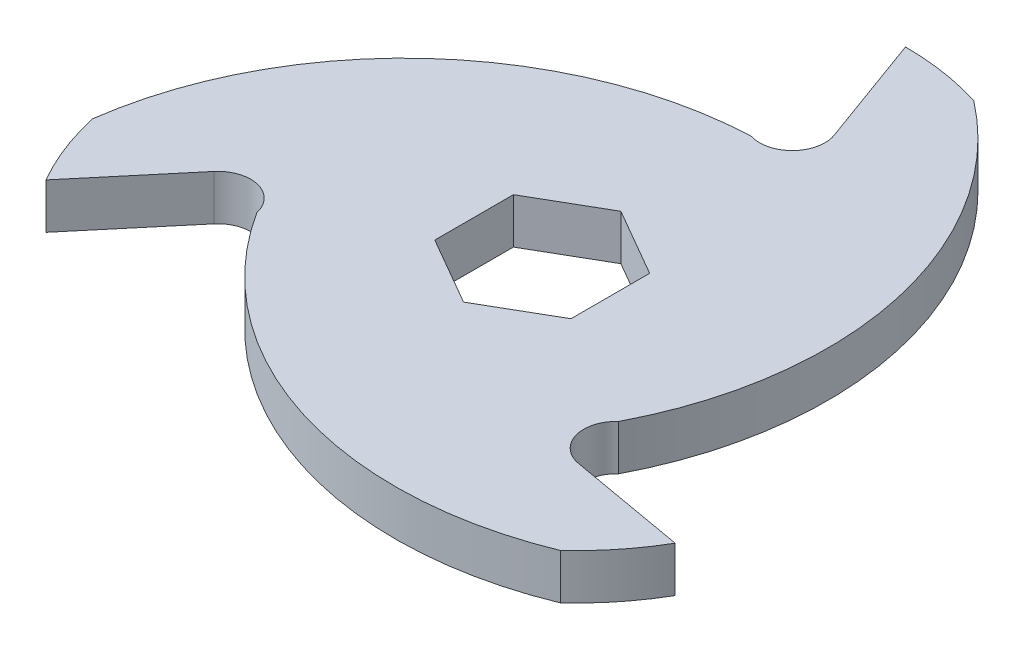
ISO-10303-21;
HEADER;
FILE_DESCRIPTION(('STEP AP214'),'2;1');
FILE_NAME('part.step','',(''),(''),'','','');
FILE_SCHEMA(('AUTOMOTIVE_DESIGN { 1 0 10303 214 1 1 1 1 }'));
ENDSEC;
DATA;
#1=APPLICATION_CONTEXT('core data for automotive mechanical design processes');
#2=APPLICATION_PROTOCOL_DEFINITION('international standard','automotive_design',2000,#1);
#3=PRODUCT_CONTEXT('',#1,'mechanical');
#4=PRODUCT('Part','Part','',(#3));
#5=PRODUCT_RELATED_PRODUCT_CATEGORY('part','',(#4));
#6=PRODUCT_DEFINITION_FORMATION('','',#4);
#7=PRODUCT_DEFINITION_CONTEXT('part definition',#1,'design');
#8=PRODUCT_DEFINITION('design','',#6,#7);
#9=PRODUCT_DEFINITION_SHAPE('','',#8);
#10=(LENGTH_UNIT() NAMED_UNIT(*) SI_UNIT(.MILLI.,.METRE.));
#11=(NAMED_UNIT(*) PLANE_ANGLE_UNIT() SI_UNIT($,.RADIAN.));
#12=(NAMED_UNIT(*) SI_UNIT($,.STERADIAN.) SOLID_ANGLE_UNIT());
#13=UNCERTAINTY_MEASURE_WITH_UNIT(LENGTH_MEASURE(1.E-05),#10,'distance_accuracy_value','');
#14=(GEOMETRIC_REPRESENTATION_CONTEXT(3) GLOBAL_UNCERTAINTY_ASSIGNED_CONTEXT((#13)) GLOBAL_UNIT_ASSIGNED_CONTEXT((#10,
#11,#12)) REPRESENTATION_CONTEXT('',''));
#15=CARTESIAN_POINT('',(0.,0.,0.));
#16=DIRECTION('',(0.,0.,1.));
#17=DIRECTION('',(1.,0.,0.));
#18=AXIS2_PLACEMENT_3D('',#15,#16,#17);
#19=CARTESIAN_POINT('',(0.,3.175,0.));
#20=DIRECTION('',(0.,1.,0.));
#21=DIRECTION('',(0.,0.,1.));
#22=AXIS2_PLACEMENT_3D('',#19,#20,#21);
#23=PLANE('',#22);
#24=DIRECTION('',(-0.866025403784439,0.,-0.5));
#25=VECTOR('',#24,1.);
#26=CARTESIAN_POINT('',(4.7625,3.175,-8.24889197104678));
#27=LINE('',#26,#25);
#28=CARTESIAN_POINT('',(9.52499999999999,3.175,-5.49926131403119));
#29=VERTEX_POINT('',#28);
#30=CARTESIAN_POINT('',(0.,3.175,-10.9985226280624));
#31=VERTEX_POINT('',#30);
#32=EDGE_CURVE('E240',#29,#31,#27,.T.);
#33=ORIENTED_EDGE('',*,*,#32,.F.);
#34=DIRECTION('',(0.,0.,-1.));
#35=VECTOR('',#34,1.);
#36=CARTESIAN_POINT('',(9.52499999999999,3.175,0.));
#37=LINE('',#36,#35);
#38=CARTESIAN_POINT('',(9.525,3.175,5.4992613140312));
#39=VERTEX_POINT('',#38);
#40=EDGE_CURVE('E269',#39,#29,#37,.T.);
#41=ORIENTED_EDGE('',*,*,#40,.F.);
#42=DIRECTION('',(0.866025403784439,0.,-0.5));
#43=VECTOR('',#42,1.);
#44=CARTESIAN_POINT('',(4.7625,3.175,8.24889197104679));
#45=LINE('',#44,#43);
#46=CARTESIAN_POINT('',(0.,3.175,10.9985226280624));
#47=VERTEX_POINT('',#46);
#48=EDGE_CURVE('E277',#47,#39,#45,.T.);
#49=ORIENTED_EDGE('',*,*,#48,.F.);
#50=DIRECTION('',(0.866025403784439,0.,0.5));
#51=VECTOR('',#50,1.);
#52=CARTESIAN_POINT('',(-4.76250000000001,3.175,8.24889197104678));
#53=LINE('',#52,#51);
#54=CARTESIAN_POINT('',(-9.52500000000001,3.175,5.49926131403119));
#55=VERTEX_POINT('',#54);
#56=EDGE_CURVE('E283',#55,#47,#53,.T.);
#57=ORIENTED_EDGE('',*,*,#56,.F.);
#58=DIRECTION('',(0.,0.,1.));
#59=VECTOR('',#58,1.);
#60=CARTESIAN_POINT('',(-9.52500000000001,3.175,0.));
#61=LINE('',#60,#59);
#62=CARTESIAN_POINT('',(-9.52500000000001,3.175,-5.49926131403119));
#63=VERTEX_POINT('',#62);
#64=EDGE_CURVE('E287',#63,#55,#61,.T.);
#65=ORIENTED_EDGE('',*,*,#64,.F.);
#66=DIRECTION('',(-0.866025403784439,0.,0.5));
#67=VECTOR('',#66,1.);
#68=CARTESIAN_POINT('',(-4.7625,3.175,-8.24889197104678));
#69=LINE('',#68,#67);
#70=EDGE_CURVE('E289',#31,#63,#69,.T.);
#71=ORIENTED_EDGE('',*,*,#70,.F.);
#72=EDGE_LOOP('',(#33,#41,#49,#57,#65,#71));
#73=FACE_BOUND('',#72,.T.);
#74=CARTESIAN_POINT('',(-19.758832767773,3.175,-8.86088574661333));
#75=DIRECTION('',(0.,1.,0.));
#76=DIRECTION('',(0.,0.,1.));
#77=AXIS2_PLACEMENT_3D('',#74,#75,#76);
#78=CIRCLE('',#77,50.8);
#79=CARTESIAN_POINT('',(11.2971590607652,3.175,-49.0624450639554));
#80=VERTEX_POINT('',#79);
#81=CARTESIAN_POINT('',(25.2966020445434,3.175,14.605));
#82=VERTEX_POINT('',#81);
#83=EDGE_CURVE('E308',#80,#82,#78,.F.);
#84=ORIENTED_EDGE('',*,*,#83,.F.);
#85=CARTESIAN_POINT('',(0.,3.175,-13.2055339805825));
#86=DIRECTION('',(0.,1.,0.));
#87=DIRECTION('',(0.,0.,1.));
#88=AXIS2_PLACEMENT_3D('',#85,#86,#87);
#89=CIRCLE('',#88,37.5944660194175);
#90=CARTESIAN_POINT('',(0.,3.175,-50.8));
#91=VERTEX_POINT('',#90);
#92=EDGE_CURVE('E180',#80,#91,#89,.T.);
#93=ORIENTED_EDGE('',*,*,#92,.T.);
#94=DIRECTION('',(0.342020143325669,0.,0.939692620785908));
#95=VECTOR('',#94,1.);
#96=CARTESIAN_POINT('',(16.3268052860381,3.175,-5.94247114477798));
#97=LINE('',#96,#95);
#98=CARTESIAN_POINT('',(5.69918249679369,3.175,-35.1416247807083));
#99=VERTEX_POINT('',#98);
#100=EDGE_CURVE('E172',#91,#99,#97,.T.);
#101=ORIENTED_EDGE('',*,*,#100,.T.);
#102=CARTESIAN_POINT('',(1.39377125197146,3.175,-33.574583241318));
#103=DIRECTION('',(0.,1.,0.));
#104=DIRECTION('',(0.,0.,1.));
#105=AXIS2_PLACEMENT_3D('',#102,#103,#104);
#106=CIRCLE('',#105,4.58172294810767);
#107=CARTESIAN_POINT('',(0.,3.175,-29.21));
#108=VERTEX_POINT('',#107);
#109=EDGE_CURVE('E177',#99,#108,#106,.F.);
#110=ORIENTED_EDGE('',*,*,#109,.T.);
#111=CARTESIAN_POINT('',(2.20566422728801,3.175,21.5420939993265));
#112=DIRECTION('',(0.,1.,0.));
#113=DIRECTION('',(0.,0.,1.));
#114=AXIS2_PLACEMENT_3D('',#111,#112,#113);
#115=CIRCLE('',#114,50.8);
#116=CARTESIAN_POINT('',(-48.1379033275463,3.175,14.7475957947618));
#117=VERTEX_POINT('',#116);
#118=EDGE_CURVE('E327',#117,#108,#115,.F.);
#119=ORIENTED_EDGE('',*,*,#118,.F.);
#120=CARTESIAN_POINT('',(-11.4363278977231,3.175,6.60276699029124));
#121=DIRECTION('',(0.,1.,0.));
#122=DIRECTION('',(0.,0.,1.));
#123=AXIS2_PLACEMENT_3D('',#120,#121,#122);
#124=CIRCLE('',#123,37.5944660194175);
#125=CARTESIAN_POINT('',(-43.9940905122493,3.175,25.4));
#126=VERTEX_POINT('',#125);
#127=EDGE_CURVE('E197',#117,#126,#124,.T.);
#128=ORIENTED_EDGE('',*,*,#127,.T.);
#129=DIRECTION('',(0.642787609686538,0.,-0.766044443118979));
#130=VECTOR('',#129,1.);
#131=CARTESIAN_POINT('',(-13.3097336156527,3.175,-11.168192567962));
#132=LINE('',#131,#130);
#133=CARTESIAN_POINT('',(-33.2831310387509,3.175,12.6351755673272));
#134=VERTEX_POINT('',#133);
#135=EDGE_CURVE('E78',#126,#134,#132,.T.);
#136=ORIENTED_EDGE('',*,*,#135,.T.);
#137=CARTESIAN_POINT('',(-29.7733276344423,3.175,15.5802503093873));
#138=DIRECTION('',(0.,1.,0.));
#139=DIRECTION('',(0.,0.,1.));
#140=AXIS2_PLACEMENT_3D('',#137,#138,#139);
#141=CIRCLE('',#140,4.58172294810767);
#142=CARTESIAN_POINT('',(-25.2966020445434,3.175,14.605));
#143=VERTEX_POINT('',#142);
#144=EDGE_CURVE('E295',#134,#143,#141,.F.);
#145=ORIENTED_EDGE('',*,*,#144,.T.);
#146=CARTESIAN_POINT('',(17.5531685404851,3.175,-12.6812082527131));
#147=DIRECTION('',(0.,1.,0.));
#148=DIRECTION('',(0.,0.,1.));
#149=AXIS2_PLACEMENT_3D('',#146,#147,#148);
#150=CIRCLE('',#149,50.8);
#151=CARTESIAN_POINT('',(36.840744266781,3.175,34.3148492691941));
#152=VERTEX_POINT('',#151);
#153=EDGE_CURVE('E406',#152,#143,#150,.F.);
#154=ORIENTED_EDGE('',*,*,#153,.F.);
#155=CARTESIAN_POINT('',(11.4363278977231,3.175,6.60276699029124));
#156=DIRECTION('',(0.,1.,0.));
#157=DIRECTION('',(0.,0.,1.));
#158=AXIS2_PLACEMENT_3D('',#155,#156,#157);
#159=CIRCLE('',#158,37.5944660194175);
#160=CARTESIAN_POINT('',(43.9940905122496,3.175,25.3999999999999));
#161=VERTEX_POINT('',#160);
#162=EDGE_CURVE('E297',#152,#161,#159,.T.);
#163=ORIENTED_EDGE('',*,*,#162,.T.);
#164=DIRECTION('',(-0.984807753012208,0.,-0.173648177666931));
#165=VECTOR('',#164,1.);
#166=CARTESIAN_POINT('',(-3.01707167038532,3.175,17.1106637127399));
#167=LINE('',#166,#165);
#168=CARTESIAN_POINT('',(27.5839485419574,3.175,22.506449213381));
#169=VERTEX_POINT('',#168);
#170=EDGE_CURVE('E299',#161,#169,#167,.T.);
#171=ORIENTED_EDGE('',*,*,#170,.T.);
#172=CARTESIAN_POINT('',(28.379556382471,3.175,17.9943329319306));
#173=DIRECTION('',(0.,1.,0.));
#174=DIRECTION('',(0.,0.,1.));
#175=AXIS2_PLACEMENT_3D('',#172,#173,#174);
#176=CIRCLE('',#175,4.58172294810767);
#177=EDGE_CURVE('E301',#169,#82,#176,.F.);
#178=ORIENTED_EDGE('',*,*,#177,.T.);
#179=EDGE_LOOP('',(#84,#93,#101,#110,#119,#128,#136,#145,#154,#163,#171,#178));
#180=FACE_BOUND('',#179,.T.);
#181=ADVANCED_FACE('F59',(#73,#180),#23,.T.);
#182=CARTESIAN_POINT('',(0.,-3.175,0.));
#183=DIRECTION('',(0.,1.,0.));
#184=DIRECTION('',(0.,0.,1.));
#185=AXIS2_PLACEMENT_3D('',#182,#183,#184);
#186=PLANE('',#185);
#187=DIRECTION('',(-0.866025403784439,0.,-0.5));
#188=VECTOR('',#187,1.);
#189=CARTESIAN_POINT('',(4.7625,-3.175,-8.24889197104678));
#190=LINE('',#189,#188);
#191=CARTESIAN_POINT('',(9.52499999999999,-3.175,-5.49926131403119));
#192=VERTEX_POINT('',#191);
#193=CARTESIAN_POINT('',(0.,-3.175,-10.9985226280624));
#194=VERTEX_POINT('',#193);
#195=EDGE_CURVE('E204',#192,#194,#190,.T.);
#196=ORIENTED_EDGE('',*,*,#195,.T.);
#197=DIRECTION('',(-0.866025403784439,0.,0.5));
#198=VECTOR('',#197,1.);
#199=CARTESIAN_POINT('',(-4.7625,-3.175,-8.24889197104678));
#200=LINE('',#199,#198);
#201=CARTESIAN_POINT('',(-9.52500000000001,-3.175,-5.49926131403119));
#202=VERTEX_POINT('',#201);
#203=EDGE_CURVE('E220',#194,#202,#200,.T.);
#204=ORIENTED_EDGE('',*,*,#203,.T.);
#205=DIRECTION('',(0.,0.,1.));
#206=VECTOR('',#205,1.);
#207=CARTESIAN_POINT('',(-9.52500000000001,-3.175,0.));
#208=LINE('',#207,#206);
#209=CARTESIAN_POINT('',(-9.52500000000001,-3.175,5.49926131403119));
#210=VERTEX_POINT('',#209);
#211=EDGE_CURVE('E217',#202,#210,#208,.T.);
#212=ORIENTED_EDGE('',*,*,#211,.T.);
#213=DIRECTION('',(0.866025403784439,0.,0.5));
#214=VECTOR('',#213,1.);
#215=CARTESIAN_POINT('',(-4.76250000000001,-3.175,8.24889197104678));
#216=LINE('',#215,#214);
#217=CARTESIAN_POINT('',(0.,-3.175,10.9985226280624));
#218=VERTEX_POINT('',#217);
#219=EDGE_CURVE('E214',#210,#218,#216,.T.);
#220=ORIENTED_EDGE('',*,*,#219,.T.);
#221=DIRECTION('',(0.866025403784439,0.,-0.5));
#222=VECTOR('',#221,1.);
#223=CARTESIAN_POINT('',(4.7625,-3.175,8.24889197104679));
#224=LINE('',#223,#222);
#225=CARTESIAN_POINT('',(9.525,-3.175,5.4992613140312));
#226=VERTEX_POINT('',#225);
#227=EDGE_CURVE('E211',#218,#226,#224,.T.);
#228=ORIENTED_EDGE('',*,*,#227,.T.);
#229=DIRECTION('',(0.,0.,-1.));
#230=VECTOR('',#229,1.);
#231=CARTESIAN_POINT('',(9.52499999999999,-3.175,0.));
#232=LINE('',#231,#230);
#233=EDGE_CURVE('E207',#226,#192,#232,.T.);
#234=ORIENTED_EDGE('',*,*,#233,.T.);
#235=EDGE_LOOP('',(#196,#204,#212,#220,#228,#234));
#236=FACE_BOUND('',#235,.T.);
#237=CARTESIAN_POINT('',(0.,-3.175,-13.2055339805825));
#238=DIRECTION('',(0.,1.,0.));
#239=DIRECTION('',(0.,0.,1.));
#240=AXIS2_PLACEMENT_3D('',#237,#238,#239);
#241=CIRCLE('',#240,37.5944660194175);
#242=CARTESIAN_POINT('',(11.2971590607652,-3.175,-49.0624450639554));
#243=VERTEX_POINT('',#242);
#244=CARTESIAN_POINT('',(0.,-3.175,-50.8));
#245=VERTEX_POINT('',#244);
#246=EDGE_CURVE('E233',#243,#245,#241,.T.);
#247=ORIENTED_EDGE('',*,*,#246,.F.);
#248=CARTESIAN_POINT('',(-19.758832767773,-3.175,-8.86088574661333));
#249=DIRECTION('',(0.,1.,0.));
#250=DIRECTION('',(0.,0.,1.));
#251=AXIS2_PLACEMENT_3D('',#248,#249,#250);
#252=CIRCLE('',#251,50.8);
#253=CARTESIAN_POINT('',(25.2966020445434,-3.175,14.605));
#254=VERTEX_POINT('',#253);
#255=EDGE_CURVE('E321',#243,#254,#252,.F.);
#256=ORIENTED_EDGE('',*,*,#255,.T.);
#257=CARTESIAN_POINT('',(28.379556382471,-3.175,17.9943329319306));
#258=DIRECTION('',(0.,1.,0.));
#259=DIRECTION('',(0.,0.,1.));
#260=AXIS2_PLACEMENT_3D('',#257,#258,#259);
#261=CIRCLE('',#260,4.58172294810767);
#262=CARTESIAN_POINT('',(27.5839485419574,-3.175,22.506449213381));
#263=VERTEX_POINT('',#262);
#264=EDGE_CURVE('E230',#263,#254,#261,.F.);
#265=ORIENTED_EDGE('',*,*,#264,.F.);
#266=DIRECTION('',(-0.984807753012208,0.,-0.173648177666931));
#267=VECTOR('',#266,1.);
#268=CARTESIAN_POINT('',(-3.01707167038532,-3.175,17.1106637127399));
#269=LINE('',#268,#267);
#270=CARTESIAN_POINT('',(43.9940905122496,-3.175,25.3999999999999));
#271=VERTEX_POINT('',#270);
#272=EDGE_CURVE('E228',#271,#263,#269,.T.);
#273=ORIENTED_EDGE('',*,*,#272,.F.);
#274=CARTESIAN_POINT('',(11.4363278977231,-3.175,6.60276699029124));
#275=DIRECTION('',(0.,1.,0.));
#276=DIRECTION('',(0.,0.,1.));
#277=AXIS2_PLACEMENT_3D('',#274,#275,#276);
#278=CIRCLE('',#277,37.5944660194175);
#279=CARTESIAN_POINT('',(36.840744266781,-3.175,34.3148492691941));
#280=VERTEX_POINT('',#279);
#281=EDGE_CURVE('E226',#280,#271,#278,.T.);
#282=ORIENTED_EDGE('',*,*,#281,.F.);
#283=CARTESIAN_POINT('',(17.5531685404851,-3.175,-12.6812082527131));
#284=DIRECTION('',(0.,1.,0.));
#285=DIRECTION('',(0.,0.,1.));
#286=AXIS2_PLACEMENT_3D('',#283,#284,#285);
#287=CIRCLE('',#286,50.8);
#288=CARTESIAN_POINT('',(-25.2966020445434,-3.175,14.605));
#289=VERTEX_POINT('',#288);
#290=EDGE_CURVE('E401',#280,#289,#287,.F.);
#291=ORIENTED_EDGE('',*,*,#290,.T.);
#292=CARTESIAN_POINT('',(-29.7733276344423,-3.175,15.5802503093873));
#293=DIRECTION('',(0.,1.,0.));
#294=DIRECTION('',(0.,0.,1.));
#295=AXIS2_PLACEMENT_3D('',#292,#293,#294);
#296=CIRCLE('',#295,4.58172294810767);
#297=CARTESIAN_POINT('',(-33.2831310387509,-3.175,12.6351755673272));
#298=VERTEX_POINT('',#297);
#299=EDGE_CURVE('E223',#298,#289,#296,.F.);
#300=ORIENTED_EDGE('',*,*,#299,.F.);
#301=DIRECTION('',(0.642787609686538,0.,-0.766044443118979));
#302=VECTOR('',#301,1.);
#303=CARTESIAN_POINT('',(-13.3097336156527,-3.175,-11.168192567962));
#304=LINE('',#303,#302);
#305=CARTESIAN_POINT('',(-43.9940905122493,-3.175,25.4));
#306=VERTEX_POINT('',#305);
#307=EDGE_CURVE('E134',#306,#298,#304,.T.);
#308=ORIENTED_EDGE('',*,*,#307,.F.);
#309=CARTESIAN_POINT('',(-11.4363278977231,-3.175,6.60276699029124));
#310=DIRECTION('',(0.,1.,0.));
#311=DIRECTION('',(0.,0.,1.));
#312=AXIS2_PLACEMENT_3D('',#309,#310,#311);
#313=CIRCLE('',#312,37.5944660194175);
#314=CARTESIAN_POINT('',(-48.1379033275463,-3.175,14.7475957947618));
#315=VERTEX_POINT('',#314);
#316=EDGE_CURVE('E128',#315,#306,#313,.T.);
#317=ORIENTED_EDGE('',*,*,#316,.F.);
#318=CARTESIAN_POINT('',(2.20566422728801,-3.175,21.5420939993265));
#319=DIRECTION('',(0.,1.,0.));
#320=DIRECTION('',(0.,0.,1.));
#321=AXIS2_PLACEMENT_3D('',#318,#319,#320);
#322=CIRCLE('',#321,50.8);
#323=CARTESIAN_POINT('',(0.,-3.175,-29.21));
#324=VERTEX_POINT('',#323);
#325=EDGE_CURVE('E334',#315,#324,#322,.F.);
#326=ORIENTED_EDGE('',*,*,#325,.T.);
#327=CARTESIAN_POINT('',(1.39377125197146,-3.175,-33.574583241318));
#328=DIRECTION('',(0.,1.,0.));
#329=DIRECTION('',(0.,0.,1.));
#330=AXIS2_PLACEMENT_3D('',#327,#328,#329);
#331=CIRCLE('',#330,4.58172294810767);
#332=CARTESIAN_POINT('',(5.69918249679369,-3.175,-35.1416247807083));
#333=VERTEX_POINT('',#332);
#334=EDGE_CURVE('E236',#333,#324,#331,.F.);
#335=ORIENTED_EDGE('',*,*,#334,.F.);
#336=DIRECTION('',(0.342020143325669,0.,0.939692620785908));
#337=VECTOR('',#336,1.);
#338=CARTESIAN_POINT('',(16.3268052860381,-3.175,-5.94247114477798));
#339=LINE('',#338,#337);
#340=EDGE_CURVE('E189',#245,#333,#339,.T.);
#341=ORIENTED_EDGE('',*,*,#340,.F.);
#342=EDGE_LOOP('',(#247,#256,#265,#273,#282,#291,#300,#308,#317,#326,#335,#341));
#343=FACE_BOUND('',#342,.T.);
#344=ADVANCED_FACE('F272',(#236,#343),#186,.F.);
#345=CARTESIAN_POINT('',(-29.7733276344423,3.175,15.5802503093873));
#346=DIRECTION('',(0.,-1.,0.));
#347=DIRECTION('',(0.,0.,-1.));
#348=AXIS2_PLACEMENT_3D('',#345,#346,#347);
#349=CYLINDRICAL_SURFACE('',#348,4.58172294810767);
#350=ORIENTED_EDGE('',*,*,#299,.T.);
#351=DIRECTION('',(0.,-1.,0.));
#352=VECTOR('',#351,1.);
#353=CARTESIAN_POINT('',(-25.2966020445434,3.175,14.605));
#354=LINE('',#353,#352);
#355=EDGE_CURVE('E12',#143,#289,#354,.T.);
#356=ORIENTED_EDGE('',*,*,#355,.F.);
#357=ORIENTED_EDGE('',*,*,#144,.F.);
#358=DIRECTION('',(0.,-1.,0.));
#359=VECTOR('',#358,1.);
#360=CARTESIAN_POINT('',(-33.2831310387509,3.175,12.6351755673272));
#361=LINE('',#360,#359);
#362=EDGE_CURVE('E241',#134,#298,#361,.T.);
#363=ORIENTED_EDGE('',*,*,#362,.T.);
#364=EDGE_LOOP('',(#350,#356,#357,#363));
#365=FACE_BOUND('',#364,.T.);
#366=ADVANCED_FACE('F361',(#365),#349,.F.);
#367=CARTESIAN_POINT('',(11.4363278977231,3.175,6.60276699029124));
#368=DIRECTION('',(0.,-1.,0.));
#369=DIRECTION('',(0.,0.,-1.));
#370=AXIS2_PLACEMENT_3D('',#367,#368,#369);
#371=CYLINDRICAL_SURFACE('',#370,37.5944660194175);
#372=ORIENTED_EDGE('',*,*,#162,.F.);
#373=DIRECTION('',(0.,1.,0.));
#374=VECTOR('',#373,1.);
#375=CARTESIAN_POINT('',(36.840744266781,-3.175,34.3148492691941));
#376=LINE('',#375,#374);
#377=EDGE_CURVE('E329',#280,#152,#376,.T.);
#378=ORIENTED_EDGE('',*,*,#377,.F.);
#379=ORIENTED_EDGE('',*,*,#281,.T.);
#380=DIRECTION('',(0.,-1.,0.));
#381=VECTOR('',#380,1.);
#382=CARTESIAN_POINT('',(43.9940905122496,3.175,25.3999999999999));
#383=LINE('',#382,#381);
#384=EDGE_CURVE('E69',#161,#271,#383,.T.);
#385=ORIENTED_EDGE('',*,*,#384,.F.);
#386=EDGE_LOOP('',(#372,#378,#379,#385));
#387=FACE_BOUND('',#386,.T.);
#388=ADVANCED_FACE('F385',(#387),#371,.T.);
#389=CARTESIAN_POINT('',(-3.01707167038532,3.175,17.1106637127399));
#390=DIRECTION('',(-0.173648177666931,0.,0.984807753012208));
#391=DIRECTION('',(0.984807753012208,0.,0.173648177666931));
#392=AXIS2_PLACEMENT_3D('',#389,#390,#391);
#393=PLANE('',#392);
#394=ORIENTED_EDGE('',*,*,#272,.T.);
#395=DIRECTION('',(0.,-1.,0.));
#396=VECTOR('',#395,1.);
#397=CARTESIAN_POINT('',(27.5839485419574,3.175,22.506449213381));
#398=LINE('',#397,#396);
#399=EDGE_CURVE('E249',#169,#263,#398,.T.);
#400=ORIENTED_EDGE('',*,*,#399,.F.);
#401=ORIENTED_EDGE('',*,*,#170,.F.);
#402=ORIENTED_EDGE('',*,*,#384,.T.);
#403=EDGE_LOOP('',(#394,#400,#401,#402));
#404=FACE_BOUND('',#403,.T.);
#405=ADVANCED_FACE('F382',(#404),#393,.F.);
#406=CARTESIAN_POINT('',(28.379556382471,3.175,17.9943329319306));
#407=DIRECTION('',(0.,-1.,0.));
#408=DIRECTION('',(0.,0.,-1.));
#409=AXIS2_PLACEMENT_3D('',#406,#407,#408);
#410=CYLINDRICAL_SURFACE('',#409,4.58172294810767);
#411=ORIENTED_EDGE('',*,*,#264,.T.);
#412=DIRECTION('',(0.,-1.,0.));
#413=VECTOR('',#412,1.);
#414=CARTESIAN_POINT('',(25.2966020445434,3.175,14.605));
#415=LINE('',#414,#413);
#416=EDGE_CURVE('E247',#82,#254,#415,.T.);
#417=ORIENTED_EDGE('',*,*,#416,.F.);
#418=ORIENTED_EDGE('',*,*,#177,.F.);
#419=ORIENTED_EDGE('',*,*,#399,.T.);
#420=EDGE_LOOP('',(#411,#417,#418,#419));
#421=FACE_BOUND('',#420,.T.);
#422=ADVANCED_FACE('F314',(#421),#410,.F.);
#423=CARTESIAN_POINT('',(0.,3.175,-13.2055339805825));
#424=DIRECTION('',(0.,-1.,0.));
#425=DIRECTION('',(0.,0.,-1.));
#426=AXIS2_PLACEMENT_3D('',#423,#424,#425);
#427=CYLINDRICAL_SURFACE('',#426,37.5944660194175);
#428=ORIENTED_EDGE('',*,*,#92,.F.);
#429=DIRECTION('',(0.,1.,0.));
#430=VECTOR('',#429,1.);
#431=CARTESIAN_POINT('',(11.2971590607652,-3.175,-49.0624450639554));
#432=LINE('',#431,#430);
#433=EDGE_CURVE('E325',#243,#80,#432,.T.);
#434=ORIENTED_EDGE('',*,*,#433,.F.);
#435=ORIENTED_EDGE('',*,*,#246,.T.);
#436=DIRECTION('',(0.,-1.,0.));
#437=VECTOR('',#436,1.);
#438=CARTESIAN_POINT('',(0.,3.175,-50.8));
#439=LINE('',#438,#437);
#440=EDGE_CURVE('E193',#91,#245,#439,.T.);
#441=ORIENTED_EDGE('',*,*,#440,.F.);
#442=EDGE_LOOP('',(#428,#434,#435,#441));
#443=FACE_BOUND('',#442,.T.);
#444=ADVANCED_FACE('F376',(#443),#427,.T.);
#445=CARTESIAN_POINT('',(16.3268052860381,3.175,-5.94247114477798));
#446=DIRECTION('',(0.939692620785908,0.,-0.342020143325669));
#447=DIRECTION('',(-0.342020143325669,0.,-0.939692620785908));
#448=AXIS2_PLACEMENT_3D('',#445,#446,#447);
#449=PLANE('',#448);
#450=ORIENTED_EDGE('',*,*,#340,.T.);
#451=DIRECTION('',(0.,-1.,0.));
#452=VECTOR('',#451,1.);
#453=CARTESIAN_POINT('',(5.69918249679369,3.175,-35.1416247807083));
#454=LINE('',#453,#452);
#455=EDGE_CURVE('E186',#99,#333,#454,.T.);
#456=ORIENTED_EDGE('',*,*,#455,.F.);
#457=ORIENTED_EDGE('',*,*,#100,.F.);
#458=ORIENTED_EDGE('',*,*,#440,.T.);
#459=EDGE_LOOP('',(#450,#456,#457,#458));
#460=FACE_BOUND('',#459,.T.);
#461=ADVANCED_FACE('F187',(#460),#449,.F.);
#462=CARTESIAN_POINT('',(1.39377125197146,3.175,-33.574583241318));
#463=DIRECTION('',(0.,-1.,0.));
#464=DIRECTION('',(0.,0.,-1.));
#465=AXIS2_PLACEMENT_3D('',#462,#463,#464);
#466=CYLINDRICAL_SURFACE('',#465,4.58172294810767);
#467=ORIENTED_EDGE('',*,*,#334,.T.);
#468=DIRECTION('',(0.,-1.,0.));
#469=VECTOR('',#468,1.);
#470=CARTESIAN_POINT('',(0.,3.175,-29.21));
#471=LINE('',#470,#469);
#472=EDGE_CURVE('E194',#108,#324,#471,.T.);
#473=ORIENTED_EDGE('',*,*,#472,.F.);
#474=ORIENTED_EDGE('',*,*,#109,.F.);
#475=ORIENTED_EDGE('',*,*,#455,.T.);
#476=EDGE_LOOP('',(#467,#473,#474,#475));
#477=FACE_BOUND('',#476,.T.);
#478=ADVANCED_FACE('F196',(#477),#466,.F.);
#479=CARTESIAN_POINT('',(-11.4363278977231,3.175,6.60276699029124));
#480=DIRECTION('',(0.,-1.,0.));
#481=DIRECTION('',(0.,0.,-1.));
#482=AXIS2_PLACEMENT_3D('',#479,#480,#481);
#483=CYLINDRICAL_SURFACE('',#482,37.5944660194175);
#484=ORIENTED_EDGE('',*,*,#127,.F.);
#485=DIRECTION('',(0.,1.,0.));
#486=VECTOR('',#485,1.);
#487=CARTESIAN_POINT('',(-48.1379033275463,-3.175,14.7475957947618));
#488=LINE('',#487,#486);
#489=EDGE_CURVE('E208',#315,#117,#488,.T.);
#490=ORIENTED_EDGE('',*,*,#489,.F.);
#491=ORIENTED_EDGE('',*,*,#316,.T.);
#492=DIRECTION('',(0.,-1.,0.));
#493=VECTOR('',#492,1.);
#494=CARTESIAN_POINT('',(-43.9940905122493,3.175,25.4));
#495=LINE('',#494,#493);
#496=EDGE_CURVE('E243',#126,#306,#495,.T.);
#497=ORIENTED_EDGE('',*,*,#496,.F.);
#498=EDGE_LOOP('',(#484,#490,#491,#497));
#499=FACE_BOUND('',#498,.T.);
#500=ADVANCED_FACE('F369',(#499),#483,.T.);
#501=CARTESIAN_POINT('',(4.7625,3.175,-8.24889197104678));
#502=DIRECTION('',(-0.5,0.,0.866025403784439));
#503=DIRECTION('',(0.866025403784439,0.,0.5));
#504=AXIS2_PLACEMENT_3D('',#501,#502,#503);
#505=PLANE('',#504);
#506=ORIENTED_EDGE('',*,*,#195,.F.);
#507=DIRECTION('',(0.,-1.,0.));
#508=VECTOR('',#507,1.);
#509=CARTESIAN_POINT('',(9.52499999999999,3.175,-5.49926131403119));
#510=LINE('',#509,#508);
#511=EDGE_CURVE('E63',#29,#192,#510,.T.);
#512=ORIENTED_EDGE('',*,*,#511,.F.);
#513=ORIENTED_EDGE('',*,*,#32,.T.);
#514=DIRECTION('',(0.,-1.,0.));
#515=VECTOR('',#514,1.);
#516=CARTESIAN_POINT('',(0.,3.175,-10.9985226280624));
#517=LINE('',#516,#515);
#518=EDGE_CURVE('E203',#31,#194,#517,.T.);
#519=ORIENTED_EDGE('',*,*,#518,.T.);
#520=EDGE_LOOP('',(#506,#512,#513,#519));
#521=FACE_BOUND('',#520,.T.);
#522=ADVANCED_FACE('F61',(#521),#505,.T.);
#523=CARTESIAN_POINT('',(9.52499999999999,3.175,0.));
#524=DIRECTION('',(-1.,0.,0.));
#525=DIRECTION('',(0.,0.,1.));
#526=AXIS2_PLACEMENT_3D('',#523,#524,#525);
#527=PLANE('',#526);
#528=ORIENTED_EDGE('',*,*,#233,.F.);
#529=DIRECTION('',(0.,-1.,0.));
#530=VECTOR('',#529,1.);
#531=CARTESIAN_POINT('',(9.525,3.175,5.4992613140312));
#532=LINE('',#531,#530);
#533=EDGE_CURVE('E260',#39,#226,#532,.T.);
#534=ORIENTED_EDGE('',*,*,#533,.F.);
#535=ORIENTED_EDGE('',*,*,#40,.T.);
#536=ORIENTED_EDGE('',*,*,#511,.T.);
#537=EDGE_LOOP('',(#528,#534,#535,#536));
#538=FACE_BOUND('',#537,.T.);
#539=ADVANCED_FACE('F267',(#538),#527,.T.);
#540=CARTESIAN_POINT('',(4.7625,3.175,8.24889197104679));
#541=DIRECTION('',(-0.5,0.,-0.866025403784439));
#542=DIRECTION('',(-0.866025403784439,0.,0.5));
#543=AXIS2_PLACEMENT_3D('',#540,#541,#542);
#544=PLANE('',#543);
#545=ORIENTED_EDGE('',*,*,#227,.F.);
#546=DIRECTION('',(0.,-1.,0.));
#547=VECTOR('',#546,1.);
#548=CARTESIAN_POINT('',(0.,3.175,10.9985226280624));
#549=LINE('',#548,#547);
#550=EDGE_CURVE('E259',#47,#218,#549,.T.);
#551=ORIENTED_EDGE('',*,*,#550,.F.);
#552=ORIENTED_EDGE('',*,*,#48,.T.);
#553=ORIENTED_EDGE('',*,*,#533,.T.);
#554=EDGE_LOOP('',(#545,#551,#552,#553));
#555=FACE_BOUND('',#554,.T.);
#556=ADVANCED_FACE('F275',(#555),#544,.T.);
#557=CARTESIAN_POINT('',(-4.76250000000001,3.175,8.24889197104678));
#558=DIRECTION('',(0.5,0.,-0.866025403784439));
#559=DIRECTION('',(-0.866025403784439,0.,-0.5));
#560=AXIS2_PLACEMENT_3D('',#557,#558,#559);
#561=PLANE('',#560);
#562=ORIENTED_EDGE('',*,*,#219,.F.);
#563=DIRECTION('',(0.,-1.,0.));
#564=VECTOR('',#563,1.);
#565=CARTESIAN_POINT('',(-9.52500000000001,3.175,5.49926131403119));
#566=LINE('',#565,#564);
#567=EDGE_CURVE('E257',#55,#210,#566,.T.);
#568=ORIENTED_EDGE('',*,*,#567,.F.);
#569=ORIENTED_EDGE('',*,*,#56,.T.);
#570=ORIENTED_EDGE('',*,*,#550,.T.);
#571=EDGE_LOOP('',(#562,#568,#569,#570));
#572=FACE_BOUND('',#571,.T.);
#573=ADVANCED_FACE('F286',(#572),#561,.T.);
#574=CARTESIAN_POINT('',(-9.52500000000001,3.175,0.));
#575=DIRECTION('',(1.,0.,0.));
#576=DIRECTION('',(0.,0.,-1.));
#577=AXIS2_PLACEMENT_3D('',#574,#575,#576);
#578=PLANE('',#577);
#579=ORIENTED_EDGE('',*,*,#211,.F.);
#580=DIRECTION('',(0.,-1.,0.));
#581=VECTOR('',#580,1.);
#582=CARTESIAN_POINT('',(-9.52500000000001,3.175,-5.49926131403119));
#583=LINE('',#582,#581);
#584=EDGE_CURVE('E255',#63,#202,#583,.T.);
#585=ORIENTED_EDGE('',*,*,#584,.F.);
#586=ORIENTED_EDGE('',*,*,#64,.T.);
#587=ORIENTED_EDGE('',*,*,#567,.T.);
#588=EDGE_LOOP('',(#579,#585,#586,#587));
#589=FACE_BOUND('',#588,.T.);
#590=ADVANCED_FACE('F346',(#589),#578,.T.);
#591=CARTESIAN_POINT('',(-4.7625,3.175,-8.24889197104678));
#592=DIRECTION('',(0.5,0.,0.866025403784439));
#593=DIRECTION('',(0.866025403784439,0.,-0.5));
#594=AXIS2_PLACEMENT_3D('',#591,#592,#593);
#595=PLANE('',#594);
#596=ORIENTED_EDGE('',*,*,#203,.F.);
#597=ORIENTED_EDGE('',*,*,#518,.F.);
#598=ORIENTED_EDGE('',*,*,#70,.T.);
#599=ORIENTED_EDGE('',*,*,#584,.T.);
#600=EDGE_LOOP('',(#596,#597,#598,#599));
#601=FACE_BOUND('',#600,.T.);
#602=ADVANCED_FACE('F343',(#601),#595,.T.);
#603=CARTESIAN_POINT('',(-13.3097336156527,3.175,-11.168192567962));
#604=DIRECTION('',(-0.766044443118979,0.,-0.642787609686538));
#605=DIRECTION('',(-0.642787609686538,0.,0.766044443118979));
#606=AXIS2_PLACEMENT_3D('',#603,#604,#605);
#607=PLANE('',#606);
#608=ORIENTED_EDGE('',*,*,#307,.T.);
#609=ORIENTED_EDGE('',*,*,#362,.F.);
#610=ORIENTED_EDGE('',*,*,#135,.F.);
#611=ORIENTED_EDGE('',*,*,#496,.T.);
#612=EDGE_LOOP('',(#608,#609,#610,#611));
#613=FACE_BOUND('',#612,.T.);
#614=ADVANCED_FACE('F353',(#613),#607,.F.);
#615=CARTESIAN_POINT('',(2.20566422728801,-3.175,21.5420939993265));
#616=DIRECTION('',(0.,1.,0.));
#617=DIRECTION('',(0.,0.,1.));
#618=AXIS2_PLACEMENT_3D('',#615,#616,#617);
#619=CYLINDRICAL_SURFACE('',#618,50.8);
#620=ORIENTED_EDGE('',*,*,#118,.T.);
#621=ORIENTED_EDGE('',*,*,#472,.T.);
#622=ORIENTED_EDGE('',*,*,#325,.F.);
#623=ORIENTED_EDGE('',*,*,#489,.T.);
#624=EDGE_LOOP('',(#620,#621,#622,#623));
#625=FACE_BOUND('',#624,.T.);
#626=ADVANCED_FACE('F364',(#625),#619,.T.);
#627=CARTESIAN_POINT('',(17.5531685404851,-3.175,-12.6812082527131));
#628=DIRECTION('',(0.,1.,0.));
#629=DIRECTION('',(0.,0.,1.));
#630=AXIS2_PLACEMENT_3D('',#627,#628,#629);
#631=CYLINDRICAL_SURFACE('',#630,50.8);
#632=ORIENTED_EDGE('',*,*,#153,.T.);
#633=ORIENTED_EDGE('',*,*,#355,.T.);
#634=ORIENTED_EDGE('',*,*,#290,.F.);
#635=ORIENTED_EDGE('',*,*,#377,.T.);
#636=EDGE_LOOP('',(#632,#633,#634,#635));
#637=FACE_BOUND('',#636,.T.);
#638=ADVANCED_FACE('F410',(#637),#631,.T.);
#639=CARTESIAN_POINT('',(-19.758832767773,-3.175,-8.86088574661333));
#640=DIRECTION('',(0.,1.,0.));
#641=DIRECTION('',(0.,0.,1.));
#642=AXIS2_PLACEMENT_3D('',#639,#640,#641);
#643=CYLINDRICAL_SURFACE('',#642,50.8);
#644=ORIENTED_EDGE('',*,*,#83,.T.);
#645=ORIENTED_EDGE('',*,*,#416,.T.);
#646=ORIENTED_EDGE('',*,*,#255,.F.);
#647=ORIENTED_EDGE('',*,*,#433,.T.);
#648=EDGE_LOOP('',(#644,#645,#646,#647));
#649=FACE_BOUND('',#648,.T.);
#650=ADVANCED_FACE('F319',(#649),#643,.T.);
#651=CLOSED_SHELL('',(#181,#344,#366,#388,#405,#422,#444,#461,#478,#500,#522,#539,#556,#573,
#590,#602,#614,#626,#638,#650));
#652=MANIFOLD_SOLID_BREP('B2',#651);
#653=ADVANCED_BREP_SHAPE_REPRESENTATION('',(#18,#652),#14);
#654=SHAPE_DEFINITION_REPRESENTATION(#9,#653);
ENDSEC;
END-ISO-10303-21;
